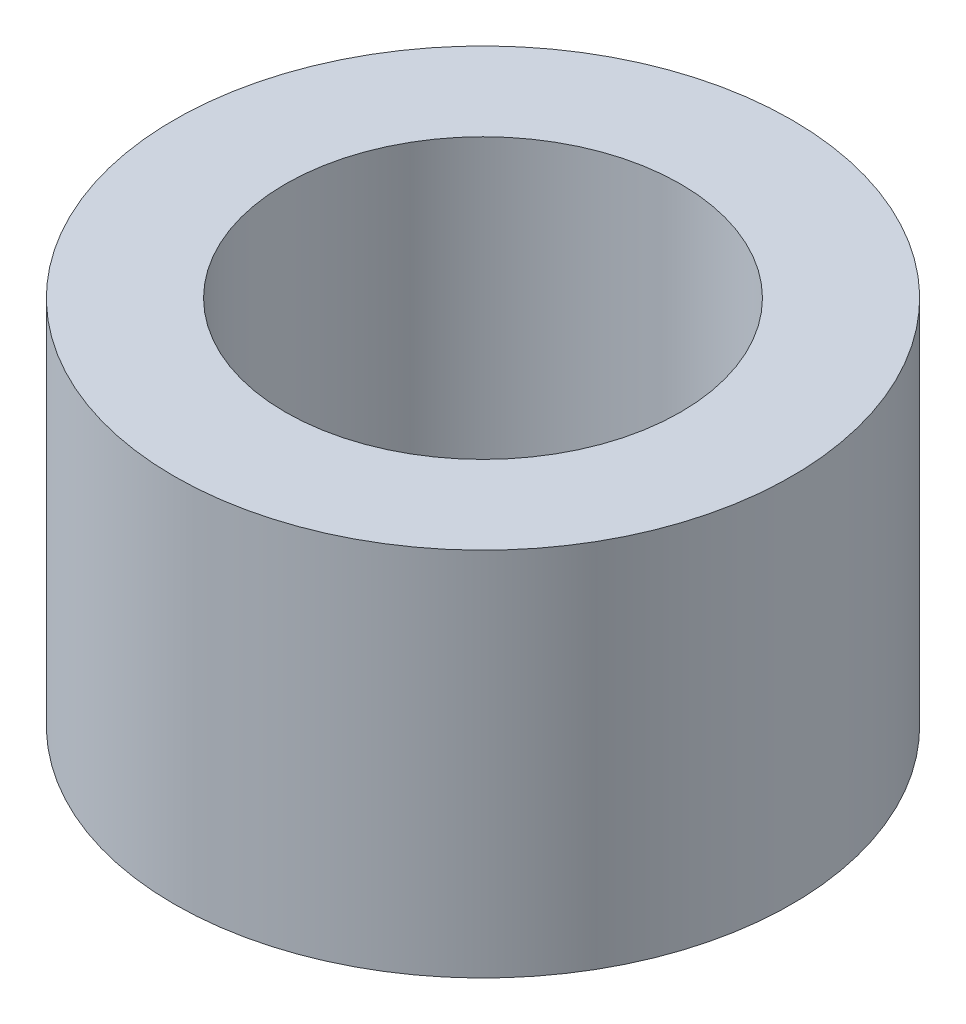
ISO-10303-21;
HEADER;
FILE_DESCRIPTION(('STEP AP214'),'2;1');
FILE_NAME('part.step','',(''),(''),'','','');
FILE_SCHEMA(('AUTOMOTIVE_DESIGN { 1 0 10303 214 1 1 1 1 }'));
ENDSEC;
DATA;
#1=APPLICATION_CONTEXT('core data for automotive mechanical design processes');
#2=APPLICATION_PROTOCOL_DEFINITION('international standard','automotive_design',2000,#1);
#3=PRODUCT_CONTEXT('',#1,'mechanical');
#4=PRODUCT('Part','Part','',(#3));
#5=PRODUCT_RELATED_PRODUCT_CATEGORY('part','',(#4));
#6=PRODUCT_DEFINITION_FORMATION('','',#4);
#7=PRODUCT_DEFINITION_CONTEXT('part definition',#1,'design');
#8=PRODUCT_DEFINITION('design','',#6,#7);
#9=PRODUCT_DEFINITION_SHAPE('','',#8);
#10=(LENGTH_UNIT() NAMED_UNIT(*) SI_UNIT(.MILLI.,.METRE.));
#11=(NAMED_UNIT(*) PLANE_ANGLE_UNIT() SI_UNIT($,.RADIAN.));
#12=(NAMED_UNIT(*) SI_UNIT($,.STERADIAN.) SOLID_ANGLE_UNIT());
#13=UNCERTAINTY_MEASURE_WITH_UNIT(LENGTH_MEASURE(1.E-05),#10,'distance_accuracy_value','');
#14=(GEOMETRIC_REPRESENTATION_CONTEXT(3) GLOBAL_UNCERTAINTY_ASSIGNED_CONTEXT((#13)) GLOBAL_UNIT_ASSIGNED_CONTEXT((#10,
#11,#12)) REPRESENTATION_CONTEXT('',''));
#15=CARTESIAN_POINT('',(0.,0.,0.));
#16=DIRECTION('',(0.,0.,1.));
#17=DIRECTION('',(1.,0.,0.));
#18=AXIS2_PLACEMENT_3D('',#15,#16,#17);
#19=CARTESIAN_POINT('',(0.,3.,0.));
#20=DIRECTION('',(0.,1.,0.));
#21=DIRECTION('',(0.,0.,1.));
#22=AXIS2_PLACEMENT_3D('',#19,#20,#21);
#23=PLANE('',#22);
#24=CARTESIAN_POINT('',(0.,3.,0.));
#25=DIRECTION('',(0.,1.,0.));
#26=DIRECTION('',(0.,0.,1.));
#27=AXIS2_PLACEMENT_3D('',#24,#25,#26);
#28=CIRCLE('',#27,2.5);
#29=CARTESIAN_POINT('',(0.,3.,2.5));
#30=VERTEX_POINT('',#29);
#31=EDGE_CURVE('E10',#30,#30,#28,.T.);
#32=ORIENTED_EDGE('',*,*,#31,.T.);
#33=EDGE_LOOP('',(#32));
#34=FACE_BOUND('',#33,.T.);
#35=CARTESIAN_POINT('',(0.,3.,0.));
#36=DIRECTION('',(0.,1.,0.));
#37=DIRECTION('',(0.,0.,1.));
#38=AXIS2_PLACEMENT_3D('',#35,#36,#37);
#39=CIRCLE('',#38,1.6);
#40=CARTESIAN_POINT('',(0.,3.,1.6));
#41=VERTEX_POINT('',#40);
#42=EDGE_CURVE('E42',#41,#41,#39,.T.);
#43=ORIENTED_EDGE('',*,*,#42,.F.);
#44=EDGE_LOOP('',(#43));
#45=FACE_BOUND('',#44,.T.);
#46=ADVANCED_FACE('F31',(#34,#45),#23,.T.);
#47=CARTESIAN_POINT('',(0.,0.,0.));
#48=DIRECTION('',(0.,1.,0.));
#49=DIRECTION('',(0.,0.,1.));
#50=AXIS2_PLACEMENT_3D('',#47,#48,#49);
#51=PLANE('',#50);
#52=CARTESIAN_POINT('',(0.,0.,0.));
#53=DIRECTION('',(0.,1.,0.));
#54=DIRECTION('',(0.,0.,1.));
#55=AXIS2_PLACEMENT_3D('',#52,#53,#54);
#56=CIRCLE('',#55,2.5);
#57=CARTESIAN_POINT('',(0.,0.,2.5));
#58=VERTEX_POINT('',#57);
#59=EDGE_CURVE('E35',#58,#58,#56,.T.);
#60=ORIENTED_EDGE('',*,*,#59,.F.);
#61=EDGE_LOOP('',(#60));
#62=FACE_BOUND('',#61,.T.);
#63=CARTESIAN_POINT('',(0.,0.,0.));
#64=DIRECTION('',(0.,1.,0.));
#65=DIRECTION('',(0.,0.,1.));
#66=AXIS2_PLACEMENT_3D('',#63,#64,#65);
#67=CIRCLE('',#66,1.6);
#68=CARTESIAN_POINT('',(0.,0.,1.6));
#69=VERTEX_POINT('',#68);
#70=EDGE_CURVE('E44',#69,#69,#67,.T.);
#71=ORIENTED_EDGE('',*,*,#70,.T.);
#72=EDGE_LOOP('',(#71));
#73=FACE_BOUND('',#72,.T.);
#74=ADVANCED_FACE('F54',(#62,#73),#51,.F.);
#75=CARTESIAN_POINT('',(0.,3.,0.));
#76=DIRECTION('',(0.,-1.,0.));
#77=DIRECTION('',(0.,0.,-1.));
#78=AXIS2_PLACEMENT_3D('',#75,#76,#77);
#79=CYLINDRICAL_SURFACE('',#78,2.5);
#80=ORIENTED_EDGE('',*,*,#31,.F.);
#81=EDGE_LOOP('',(#80));
#82=FACE_BOUND('',#81,.T.);
#83=ORIENTED_EDGE('',*,*,#59,.T.);
#84=EDGE_LOOP('',(#83));
#85=FACE_BOUND('',#84,.T.);
#86=ADVANCED_FACE('F33',(#82,#85),#79,.T.);
#87=CARTESIAN_POINT('',(0.,3.,0.));
#88=DIRECTION('',(0.,-1.,0.));
#89=DIRECTION('',(0.,0.,-1.));
#90=AXIS2_PLACEMENT_3D('',#87,#88,#89);
#91=CYLINDRICAL_SURFACE('',#90,1.6);
#92=ORIENTED_EDGE('',*,*,#42,.T.);
#93=EDGE_LOOP('',(#92));
#94=FACE_BOUND('',#93,.T.);
#95=ORIENTED_EDGE('',*,*,#70,.F.);
#96=EDGE_LOOP('',(#95));
#97=FACE_BOUND('',#96,.T.);
#98=ADVANCED_FACE('F50',(#94,#97),#91,.F.);
#99=CLOSED_SHELL('',(#46,#74,#86,#98));
#100=MANIFOLD_SOLID_BREP('B2',#99);
#101=ADVANCED_BREP_SHAPE_REPRESENTATION('',(#18,#100),#14);
#102=SHAPE_DEFINITION_REPRESENTATION(#9,#101);
ENDSEC;
END-ISO-10303-21;
